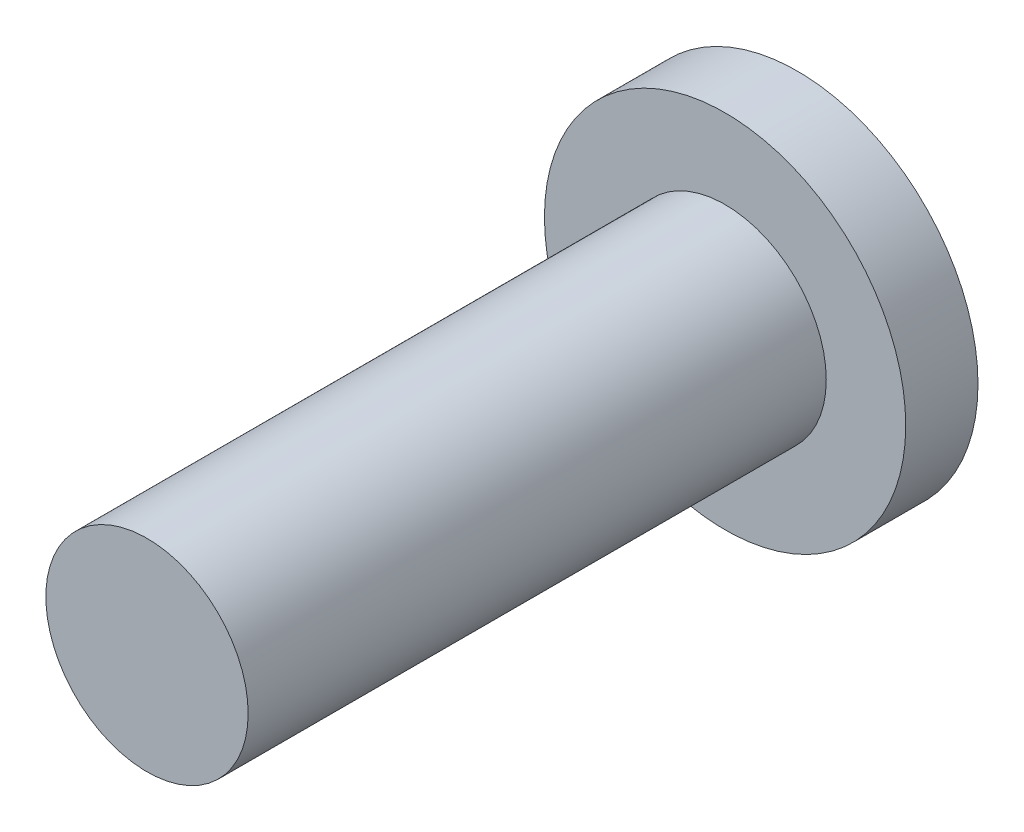
ISO-10303-21;
HEADER;
FILE_DESCRIPTION(('STEP AP214'),'2;1');
FILE_NAME('part.step','',(''),(''),'','','');
FILE_SCHEMA(('AUTOMOTIVE_DESIGN { 1 0 10303 214 1 1 1 1 }'));
ENDSEC;
DATA;
#1=APPLICATION_CONTEXT('core data for automotive mechanical design processes');
#2=APPLICATION_PROTOCOL_DEFINITION('international standard','automotive_design',2000,#1);
#3=PRODUCT_CONTEXT('',#1,'mechanical');
#4=PRODUCT('Part','Part','',(#3));
#5=PRODUCT_RELATED_PRODUCT_CATEGORY('part','',(#4));
#6=PRODUCT_DEFINITION_FORMATION('','',#4);
#7=PRODUCT_DEFINITION_CONTEXT('part definition',#1,'design');
#8=PRODUCT_DEFINITION('design','',#6,#7);
#9=PRODUCT_DEFINITION_SHAPE('','',#8);
#10=(LENGTH_UNIT() NAMED_UNIT(*) SI_UNIT(.MILLI.,.METRE.));
#11=(NAMED_UNIT(*) PLANE_ANGLE_UNIT() SI_UNIT($,.RADIAN.));
#12=(NAMED_UNIT(*) SI_UNIT($,.STERADIAN.) SOLID_ANGLE_UNIT());
#13=UNCERTAINTY_MEASURE_WITH_UNIT(LENGTH_MEASURE(1.E-05),#10,'distance_accuracy_value','');
#14=(GEOMETRIC_REPRESENTATION_CONTEXT(3) GLOBAL_UNCERTAINTY_ASSIGNED_CONTEXT((#13)) GLOBAL_UNIT_ASSIGNED_CONTEXT((#10,
#11,#12)) REPRESENTATION_CONTEXT('',''));
#15=CARTESIAN_POINT('',(0.,0.,0.));
#16=DIRECTION('',(0.,0.,1.));
#17=DIRECTION('',(1.,0.,0.));
#18=AXIS2_PLACEMENT_3D('',#15,#16,#17);
#19=CARTESIAN_POINT('',(0.,0.,8.));
#20=DIRECTION('',(0.,0.,-1.));
#21=DIRECTION('',(-1.,0.,0.));
#22=AXIS2_PLACEMENT_3D('',#19,#20,#21);
#23=CYLINDRICAL_SURFACE('',#22,1.4);
#24=CARTESIAN_POINT('',(0.,0.,8.));
#25=DIRECTION('',(0.,0.,1.));
#26=DIRECTION('',(1.,0.,0.));
#27=AXIS2_PLACEMENT_3D('',#24,#25,#26);
#28=CIRCLE('',#27,1.4);
#29=CARTESIAN_POINT('',(1.4,0.,8.));
#30=VERTEX_POINT('',#29);
#31=EDGE_CURVE('E10',#30,#30,#28,.T.);
#32=ORIENTED_EDGE('',*,*,#31,.F.);
#33=EDGE_LOOP('',(#32));
#34=FACE_BOUND('',#33,.T.);
#35=CARTESIAN_POINT('',(0.,0.,0.));
#36=DIRECTION('',(0.,0.,1.));
#37=DIRECTION('',(1.,0.,0.));
#38=AXIS2_PLACEMENT_3D('',#35,#36,#37);
#39=CIRCLE('',#38,1.4);
#40=CARTESIAN_POINT('',(1.4,0.,0.));
#41=VERTEX_POINT('',#40);
#42=EDGE_CURVE('E34',#41,#41,#39,.T.);
#43=ORIENTED_EDGE('',*,*,#42,.T.);
#44=EDGE_LOOP('',(#43));
#45=FACE_BOUND('',#44,.T.);
#46=ADVANCED_FACE('F31',(#34,#45),#23,.T.);
#47=CARTESIAN_POINT('',(0.,0.,8.));
#48=DIRECTION('',(0.,0.,1.));
#49=DIRECTION('',(1.,0.,0.));
#50=AXIS2_PLACEMENT_3D('',#47,#48,#49);
#51=PLANE('',#50);
#52=ORIENTED_EDGE('',*,*,#31,.T.);
#53=EDGE_LOOP('',(#52));
#54=FACE_BOUND('',#53,.T.);
#55=ADVANCED_FACE('F62',(#54),#51,.T.);
#56=CARTESIAN_POINT('',(0.,0.,-1.));
#57=DIRECTION('',(0.,0.,1.));
#58=DIRECTION('',(1.,0.,0.));
#59=AXIS2_PLACEMENT_3D('',#56,#57,#58);
#60=CYLINDRICAL_SURFACE('',#59,2.5);
#61=CARTESIAN_POINT('',(0.,0.,-1.));
#62=DIRECTION('',(0.,0.,1.));
#63=DIRECTION('',(1.,0.,0.));
#64=AXIS2_PLACEMENT_3D('',#61,#62,#63);
#65=CIRCLE('',#64,2.5);
#66=CARTESIAN_POINT('',(2.5,0.,-1.));
#67=VERTEX_POINT('',#66);
#68=EDGE_CURVE('E41',#67,#67,#65,.T.);
#69=ORIENTED_EDGE('',*,*,#68,.T.);
#70=EDGE_LOOP('',(#69));
#71=FACE_BOUND('',#70,.T.);
#72=CARTESIAN_POINT('',(0.,0.,0.));
#73=DIRECTION('',(0.,0.,1.));
#74=DIRECTION('',(1.,0.,0.));
#75=AXIS2_PLACEMENT_3D('',#72,#73,#74);
#76=CIRCLE('',#75,2.5);
#77=CARTESIAN_POINT('',(2.5,0.,0.));
#78=VERTEX_POINT('',#77);
#79=EDGE_CURVE('E43',#78,#78,#76,.T.);
#80=ORIENTED_EDGE('',*,*,#79,.F.);
#81=EDGE_LOOP('',(#80));
#82=FACE_BOUND('',#81,.T.);
#83=ADVANCED_FACE('F49',(#71,#82),#60,.T.);
#84=CARTESIAN_POINT('',(0.,0.,-1.));
#85=DIRECTION('',(0.,0.,1.));
#86=DIRECTION('',(1.,0.,0.));
#87=AXIS2_PLACEMENT_3D('',#84,#85,#86);
#88=PLANE('',#87);
#89=ORIENTED_EDGE('',*,*,#68,.F.);
#90=EDGE_LOOP('',(#89));
#91=FACE_BOUND('',#90,.T.);
#92=ADVANCED_FACE('F52',(#91),#88,.F.);
#93=CARTESIAN_POINT('',(0.,0.,0.));
#94=DIRECTION('',(0.,0.,1.));
#95=DIRECTION('',(1.,0.,0.));
#96=AXIS2_PLACEMENT_3D('',#93,#94,#95);
#97=PLANE('',#96);
#98=ORIENTED_EDGE('',*,*,#42,.F.);
#99=EDGE_LOOP('',(#98));
#100=FACE_BOUND('',#99,.T.);
#101=ORIENTED_EDGE('',*,*,#79,.T.);
#102=EDGE_LOOP('',(#101));
#103=FACE_BOUND('',#102,.T.);
#104=ADVANCED_FACE('F54',(#100,#103),#97,.T.);
#105=CLOSED_SHELL('',(#46,#55,#83,#92,#104));
#106=MANIFOLD_SOLID_BREP('B2',#105);
#107=ADVANCED_BREP_SHAPE_REPRESENTATION('',(#18,#106),#14);
#108=SHAPE_DEFINITION_REPRESENTATION(#9,#107);
ENDSEC;
END-ISO-10303-21;
